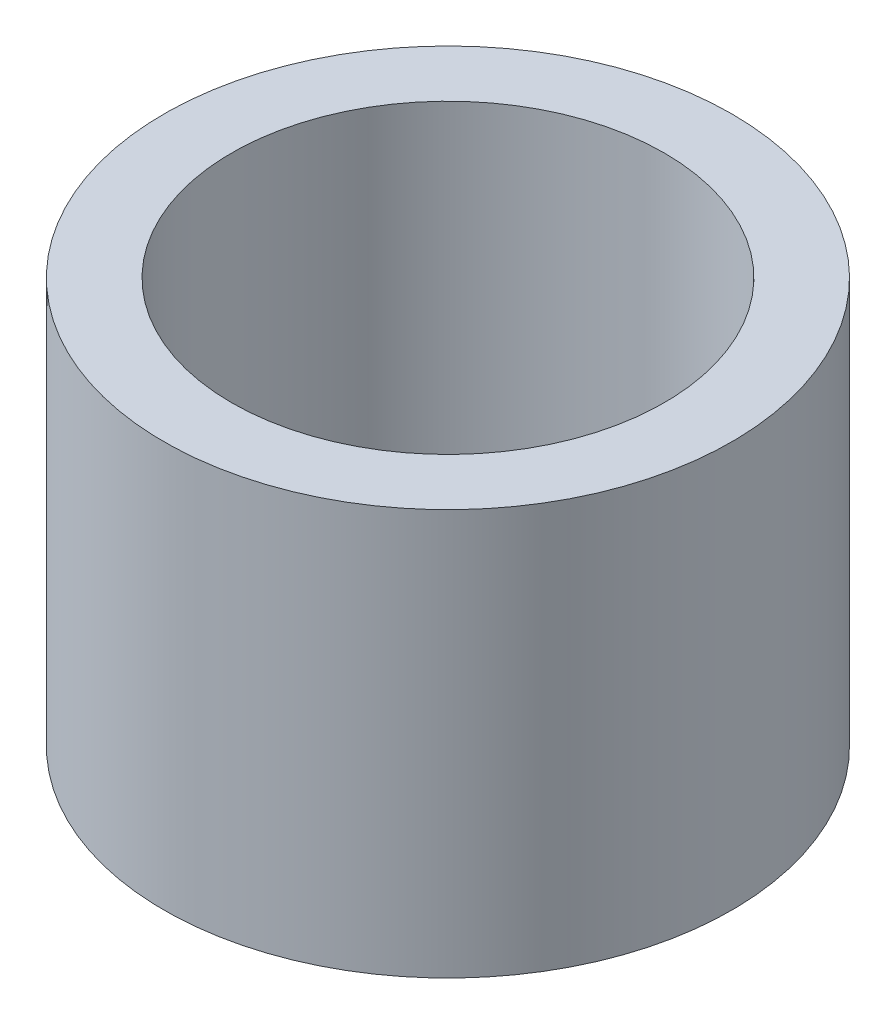
ISO-10303-21;
HEADER;
FILE_DESCRIPTION(('STEP AP214'),'2;1');
FILE_NAME('part.step','',(''),(''),'','','');
FILE_SCHEMA(('AUTOMOTIVE_DESIGN { 1 0 10303 214 1 1 1 1 }'));
ENDSEC;
DATA;
#1=APPLICATION_CONTEXT('core data for automotive mechanical design processes');
#2=APPLICATION_PROTOCOL_DEFINITION('international standard','automotive_design',2000,#1);
#3=PRODUCT_CONTEXT('',#1,'mechanical');
#4=PRODUCT('Part','Part','',(#3));
#5=PRODUCT_RELATED_PRODUCT_CATEGORY('part','',(#4));
#6=PRODUCT_DEFINITION_FORMATION('','',#4);
#7=PRODUCT_DEFINITION_CONTEXT('part definition',#1,'design');
#8=PRODUCT_DEFINITION('design','',#6,#7);
#9=PRODUCT_DEFINITION_SHAPE('','',#8);
#10=(LENGTH_UNIT() NAMED_UNIT(*) SI_UNIT(.MILLI.,.METRE.));
#11=(NAMED_UNIT(*) PLANE_ANGLE_UNIT() SI_UNIT($,.RADIAN.));
#12=(NAMED_UNIT(*) SI_UNIT($,.STERADIAN.) SOLID_ANGLE_UNIT());
#13=UNCERTAINTY_MEASURE_WITH_UNIT(LENGTH_MEASURE(1.E-05),#10,'distance_accuracy_value','');
#14=(GEOMETRIC_REPRESENTATION_CONTEXT(3) GLOBAL_UNCERTAINTY_ASSIGNED_CONTEXT((#13)) GLOBAL_UNIT_ASSIGNED_CONTEXT((#10,
#11,#12)) REPRESENTATION_CONTEXT('',''));
#15=CARTESIAN_POINT('',(0.,0.,0.));
#16=DIRECTION('',(0.,0.,1.));
#17=DIRECTION('',(1.,0.,0.));
#18=AXIS2_PLACEMENT_3D('',#15,#16,#17);
#19=CARTESIAN_POINT('',(0.,3.,0.));
#20=DIRECTION('',(0.,-1.,0.));
#21=DIRECTION('',(0.,0.,-1.));
#22=AXIS2_PLACEMENT_3D('',#19,#20,#21);
#23=CYLINDRICAL_SURFACE('',#22,1.6);
#24=CARTESIAN_POINT('',(0.,0.,0.));
#25=DIRECTION('',(0.,-1.,0.));
#26=DIRECTION('',(0.,0.,-1.));
#27=AXIS2_PLACEMENT_3D('',#24,#25,#26);
#28=CIRCLE('',#27,1.6);
#29=CARTESIAN_POINT('',(0.,0.,-1.6));
#30=VERTEX_POINT('',#29);
#31=EDGE_CURVE('E27',#30,#30,#28,.T.);
#32=ORIENTED_EDGE('',*,*,#31,.T.);
#33=EDGE_LOOP('',(#32));
#34=FACE_BOUND('',#33,.T.);
#35=CARTESIAN_POINT('',(0.,3.,0.));
#36=DIRECTION('',(0.,-1.,0.));
#37=DIRECTION('',(0.,0.,-1.));
#38=AXIS2_PLACEMENT_3D('',#35,#36,#37);
#39=CIRCLE('',#38,1.6);
#40=CARTESIAN_POINT('',(0.,3.,-1.6));
#41=VERTEX_POINT('',#40);
#42=EDGE_CURVE('E18',#41,#41,#39,.T.);
#43=ORIENTED_EDGE('',*,*,#42,.F.);
#44=EDGE_LOOP('',(#43));
#45=FACE_BOUND('',#44,.T.);
#46=ADVANCED_FACE('F15',(#34,#45),#23,.F.);
#47=CARTESIAN_POINT('',(0.,3.,0.));
#48=DIRECTION('',(0.,1.,0.));
#49=DIRECTION('',(0.,0.,1.));
#50=AXIS2_PLACEMENT_3D('',#47,#48,#49);
#51=PLANE('',#50);
#52=ORIENTED_EDGE('',*,*,#42,.T.);
#53=EDGE_LOOP('',(#52));
#54=FACE_BOUND('',#53,.T.);
#55=CARTESIAN_POINT('',(0.,3.,0.));
#56=DIRECTION('',(0.,-1.,0.));
#57=DIRECTION('',(0.,0.,-1.));
#58=AXIS2_PLACEMENT_3D('',#55,#56,#57);
#59=CIRCLE('',#58,2.1);
#60=CARTESIAN_POINT('',(0.,3.,-2.1));
#61=VERTEX_POINT('',#60);
#62=EDGE_CURVE('E22',#61,#61,#59,.T.);
#63=ORIENTED_EDGE('',*,*,#62,.F.);
#64=EDGE_LOOP('',(#63));
#65=FACE_BOUND('',#64,.T.);
#66=ADVANCED_FACE('F35',(#54,#65),#51,.T.);
#67=CARTESIAN_POINT('',(0.,0.,0.));
#68=DIRECTION('',(0.,1.,0.));
#69=DIRECTION('',(0.,0.,1.));
#70=AXIS2_PLACEMENT_3D('',#67,#68,#69);
#71=PLANE('',#70);
#72=ORIENTED_EDGE('',*,*,#31,.F.);
#73=EDGE_LOOP('',(#72));
#74=FACE_BOUND('',#73,.T.);
#75=CARTESIAN_POINT('',(0.,0.,0.));
#76=DIRECTION('',(0.,-1.,0.));
#77=DIRECTION('',(0.,0.,-1.));
#78=AXIS2_PLACEMENT_3D('',#75,#76,#77);
#79=CIRCLE('',#78,2.1);
#80=CARTESIAN_POINT('',(0.,0.,-2.1));
#81=VERTEX_POINT('',#80);
#82=EDGE_CURVE('E10',#81,#81,#79,.F.);
#83=ORIENTED_EDGE('',*,*,#82,.F.);
#84=EDGE_LOOP('',(#83));
#85=FACE_BOUND('',#84,.T.);
#86=ADVANCED_FACE('F43',(#74,#85),#71,.F.);
#87=CARTESIAN_POINT('',(0.,3.,0.));
#88=DIRECTION('',(0.,-1.,0.));
#89=DIRECTION('',(0.,0.,-1.));
#90=AXIS2_PLACEMENT_3D('',#87,#88,#89);
#91=CYLINDRICAL_SURFACE('',#90,2.1);
#92=ORIENTED_EDGE('',*,*,#82,.T.);
#93=EDGE_LOOP('',(#92));
#94=FACE_BOUND('',#93,.T.);
#95=ORIENTED_EDGE('',*,*,#62,.T.);
#96=EDGE_LOOP('',(#95));
#97=FACE_BOUND('',#96,.T.);
#98=ADVANCED_FACE('F44',(#94,#97),#91,.T.);
#99=CLOSED_SHELL('',(#46,#66,#86,#98));
#100=MANIFOLD_SOLID_BREP('B1',#99);
#101=ADVANCED_BREP_SHAPE_REPRESENTATION('',(#18,#100),#14);
#102=SHAPE_DEFINITION_REPRESENTATION(#9,#101);
ENDSEC;
END-ISO-10303-21;
